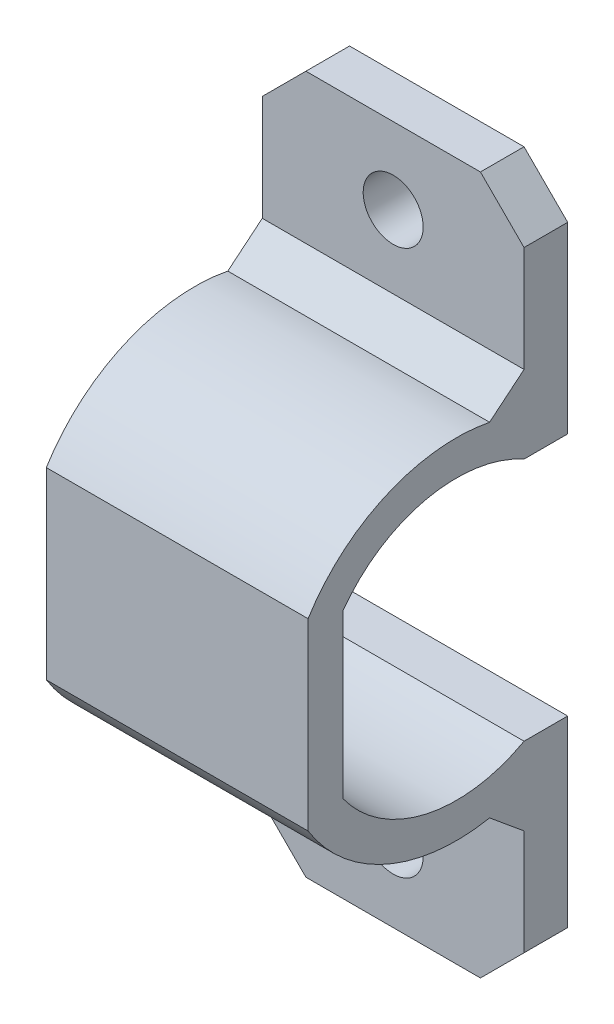
ISO-10303-21;
HEADER;
FILE_DESCRIPTION(('STEP AP214'),'2;1');
FILE_NAME('part.step','',(''),(''),'','','');
FILE_SCHEMA(('AUTOMOTIVE_DESIGN { 1 0 10303 214 1 1 1 1 }'));
ENDSEC;
DATA;
#1=APPLICATION_CONTEXT('core data for automotive mechanical design processes');
#2=APPLICATION_PROTOCOL_DEFINITION('international standard','automotive_design',2000,#1);
#3=PRODUCT_CONTEXT('',#1,'mechanical');
#4=PRODUCT('Part','Part','',(#3));
#5=PRODUCT_RELATED_PRODUCT_CATEGORY('part','',(#4));
#6=PRODUCT_DEFINITION_FORMATION('','',#4);
#7=PRODUCT_DEFINITION_CONTEXT('part definition',#1,'design');
#8=PRODUCT_DEFINITION('design','',#6,#7);
#9=PRODUCT_DEFINITION_SHAPE('','',#8);
#10=(LENGTH_UNIT() NAMED_UNIT(*) SI_UNIT(.MILLI.,.METRE.));
#11=(NAMED_UNIT(*) PLANE_ANGLE_UNIT() SI_UNIT($,.RADIAN.));
#12=(NAMED_UNIT(*) SI_UNIT($,.STERADIAN.) SOLID_ANGLE_UNIT());
#13=UNCERTAINTY_MEASURE_WITH_UNIT(LENGTH_MEASURE(1.E-05),#10,'distance_accuracy_value','');
#14=(GEOMETRIC_REPRESENTATION_CONTEXT(3) GLOBAL_UNCERTAINTY_ASSIGNED_CONTEXT((#13)) GLOBAL_UNIT_ASSIGNED_CONTEXT((#10,
#11,#12)) REPRESENTATION_CONTEXT('',''));
#15=CARTESIAN_POINT('',(0.,0.,0.));
#16=DIRECTION('',(0.,0.,1.));
#17=DIRECTION('',(1.,0.,0.));
#18=AXIS2_PLACEMENT_3D('',#15,#16,#17);
#19=CARTESIAN_POINT('',(6.,16.,-4.1));
#20=DIRECTION('',(0.,-1.,0.));
#21=DIRECTION('',(0.,0.,-1.));
#22=AXIS2_PLACEMENT_3D('',#19,#20,#21);
#23=PLANE('',#22);
#24=DIRECTION('',(-1.,0.,0.));
#25=VECTOR('',#24,1.);
#26=CARTESIAN_POINT('',(6.,16.,-5.1));
#27=LINE('',#26,#25);
#28=CARTESIAN_POINT('',(4.,16.,-5.1));
#29=VERTEX_POINT('',#28);
#30=CARTESIAN_POINT('',(-4.,16.,-5.1));
#31=VERTEX_POINT('',#30);
#32=EDGE_CURVE('E339',#29,#31,#27,.T.);
#33=ORIENTED_EDGE('',*,*,#32,.T.);
#34=DIRECTION('',(0.,0.,1.));
#35=VECTOR('',#34,1.);
#36=CARTESIAN_POINT('',(-4.,16.,-4.1));
#37=LINE('',#36,#35);
#38=CARTESIAN_POINT('',(-4.,16.,-3.1));
#39=VERTEX_POINT('',#38);
#40=EDGE_CURVE('E387',#31,#39,#37,.T.);
#41=ORIENTED_EDGE('',*,*,#40,.T.);
#42=DIRECTION('',(-1.,0.,0.));
#43=VECTOR('',#42,1.);
#44=CARTESIAN_POINT('',(6.,16.,-3.1));
#45=LINE('',#44,#43);
#46=CARTESIAN_POINT('',(4.,16.,-3.1));
#47=VERTEX_POINT('',#46);
#48=EDGE_CURVE('E377',#47,#39,#45,.T.);
#49=ORIENTED_EDGE('',*,*,#48,.F.);
#50=DIRECTION('',(0.,0.,-1.));
#51=VECTOR('',#50,1.);
#52=CARTESIAN_POINT('',(4.,16.,-5.1));
#53=LINE('',#52,#51);
#54=EDGE_CURVE('E381',#47,#29,#53,.T.);
#55=ORIENTED_EDGE('',*,*,#54,.T.);
#56=EDGE_LOOP('',(#33,#41,#49,#55));
#57=FACE_BOUND('',#56,.T.);
#58=ADVANCED_FACE('F15',(#57),#23,.F.);
#59=CARTESIAN_POINT('',(6.,11.6874788134985,-3.1));
#60=DIRECTION('',(0.,0.,-1.));
#61=DIRECTION('',(0.,1.,0.));
#62=AXIS2_PLACEMENT_3D('',#59,#60,#61);
#63=PLANE('',#62);
#64=CARTESIAN_POINT('',(0.,12.5,-3.1));
#65=DIRECTION('',(0.,0.,-1.));
#66=DIRECTION('',(0.,1.,0.));
#67=AXIS2_PLACEMENT_3D('',#64,#65,#66);
#68=CIRCLE('',#67,1.375);
#69=CARTESIAN_POINT('',(0.,13.875,-3.1));
#70=VERTEX_POINT('',#69);
#71=EDGE_CURVE('E316',#70,#70,#68,.T.);
#72=ORIENTED_EDGE('',*,*,#71,.T.);
#73=EDGE_LOOP('',(#72));
#74=FACE_BOUND('',#73,.T.);
#75=DIRECTION('',(0.,-1.,0.));
#76=VECTOR('',#75,1.);
#77=CARTESIAN_POINT('',(-6.,11.6874788134985,-3.1));
#78=LINE('',#77,#76);
#79=CARTESIAN_POINT('',(-6.,14.,-3.1));
#80=VERTEX_POINT('',#79);
#81=CARTESIAN_POINT('',(-6.,9.15913917942007,-3.1));
#82=VERTEX_POINT('',#81);
#83=EDGE_CURVE('E320',#80,#82,#78,.T.);
#84=ORIENTED_EDGE('',*,*,#83,.T.);
#85=DIRECTION('',(1.,0.,0.));
#86=VECTOR('',#85,1.);
#87=CARTESIAN_POINT('',(6.,9.15913917942007,-3.1));
#88=LINE('',#87,#86);
#89=CARTESIAN_POINT('',(6.,9.15913917942007,-3.1));
#90=VERTEX_POINT('',#89);
#91=EDGE_CURVE('E36',#82,#90,#88,.T.);
#92=ORIENTED_EDGE('',*,*,#91,.T.);
#93=DIRECTION('',(0.,-1.,0.));
#94=VECTOR('',#93,1.);
#95=CARTESIAN_POINT('',(6.,11.6874788134985,-3.1));
#96=LINE('',#95,#94);
#97=CARTESIAN_POINT('',(6.,14.,-3.1));
#98=VERTEX_POINT('',#97);
#99=EDGE_CURVE('E321',#98,#90,#96,.T.);
#100=ORIENTED_EDGE('',*,*,#99,.F.);
#101=DIRECTION('',(-0.707106781186548,0.707106781186548,0.));
#102=VECTOR('',#101,1.);
#103=CARTESIAN_POINT('',(6.,14.,-3.1));
#104=LINE('',#103,#102);
#105=EDGE_CURVE('E391',#98,#47,#104,.T.);
#106=ORIENTED_EDGE('',*,*,#105,.T.);
#107=ORIENTED_EDGE('',*,*,#48,.T.);
#108=DIRECTION('',(0.707106781186548,0.707106781186548,0.));
#109=VECTOR('',#108,1.);
#110=CARTESIAN_POINT('',(-4.,16.,-3.1));
#111=LINE('',#110,#109);
#112=EDGE_CURVE('E394',#39,#80,#111,.F.);
#113=ORIENTED_EDGE('',*,*,#112,.T.);
#114=EDGE_LOOP('',(#84,#92,#100,#106,#107,#113));
#115=FACE_BOUND('',#114,.T.);
#116=ADVANCED_FACE('F500',(#74,#115),#63,.F.);
#117=CARTESIAN_POINT('',(6.,0.,0.));
#118=DIRECTION('',(-1.,0.,0.));
#119=DIRECTION('',(0.,0.,1.));
#120=AXIS2_PLACEMENT_3D('',#117,#118,#119);
#121=CYLINDRICAL_SURFACE('',#120,8.);
#122=CARTESIAN_POINT('',(6.,0.,0.));
#123=DIRECTION('',(-1.,0.,0.));
#124=DIRECTION('',(0.,0.,-1.));
#125=AXIS2_PLACEMENT_3D('',#122,#123,#124);
#126=CIRCLE('',#125,8.);
#127=CARTESIAN_POINT('',(6.,4.2142615011411,6.8));
#128=VERTEX_POINT('',#127);
#129=CARTESIAN_POINT('',(6.,7.85448792630598,-1.51888755854856));
#130=VERTEX_POINT('',#129);
#131=EDGE_CURVE('E206',#128,#130,#126,.T.);
#132=ORIENTED_EDGE('',*,*,#131,.T.);
#133=DIRECTION('',(-1.,0.,0.));
#134=VECTOR('',#133,1.);
#135=CARTESIAN_POINT('',(6.,7.85448792630598,-1.51888755854856));
#136=LINE('',#135,#134);
#137=CARTESIAN_POINT('',(-6.,7.85448792630598,-1.51888755854856));
#138=VERTEX_POINT('',#137);
#139=EDGE_CURVE('E416',#130,#138,#136,.T.);
#140=ORIENTED_EDGE('',*,*,#139,.T.);
#141=CARTESIAN_POINT('',(-6.,0.,0.));
#142=DIRECTION('',(-1.,0.,0.));
#143=DIRECTION('',(0.,0.,-1.));
#144=AXIS2_PLACEMENT_3D('',#141,#142,#143);
#145=CIRCLE('',#144,8.);
#146=CARTESIAN_POINT('',(-6.,4.2142615011411,6.8));
#147=VERTEX_POINT('',#146);
#148=EDGE_CURVE('E342',#147,#138,#145,.T.);
#149=ORIENTED_EDGE('',*,*,#148,.F.);
#150=DIRECTION('',(-1.,0.,0.));
#151=VECTOR('',#150,1.);
#152=CARTESIAN_POINT('',(6.,4.2142615011411,6.8));
#153=LINE('',#152,#151);
#154=EDGE_CURVE('E374',#128,#147,#153,.T.);
#155=ORIENTED_EDGE('',*,*,#154,.F.);
#156=EDGE_LOOP('',(#132,#140,#149,#155));
#157=FACE_BOUND('',#156,.T.);
#158=ADVANCED_FACE('F527',(#157),#121,.T.);
#159=CARTESIAN_POINT('',(6.,2.10713075057055,6.8));
#160=DIRECTION('',(0.,0.,1.));
#161=DIRECTION('',(1.,0.,0.));
#162=AXIS2_PLACEMENT_3D('',#159,#160,#161);
#163=PLANE('',#162);
#164=DIRECTION('',(0.,1.,0.));
#165=VECTOR('',#164,1.);
#166=CARTESIAN_POINT('',(-6.,2.10713075057055,6.8));
#167=LINE('',#166,#165);
#168=CARTESIAN_POINT('',(-6.,-4.2142615011411,6.8));
#169=VERTEX_POINT('',#168);
#170=EDGE_CURVE('E215',#169,#147,#167,.T.);
#171=ORIENTED_EDGE('',*,*,#170,.F.);
#172=DIRECTION('',(-1.,0.,0.));
#173=VECTOR('',#172,1.);
#174=CARTESIAN_POINT('',(6.,-4.2142615011411,6.8));
#175=LINE('',#174,#173);
#176=CARTESIAN_POINT('',(6.,-4.2142615011411,6.8));
#177=VERTEX_POINT('',#176);
#178=EDGE_CURVE('E212',#177,#169,#175,.T.);
#179=ORIENTED_EDGE('',*,*,#178,.F.);
#180=DIRECTION('',(0.,1.,0.));
#181=VECTOR('',#180,1.);
#182=CARTESIAN_POINT('',(6.,2.10713075057055,6.8));
#183=LINE('',#182,#181);
#184=EDGE_CURVE('E198',#177,#128,#183,.T.);
#185=ORIENTED_EDGE('',*,*,#184,.T.);
#186=ORIENTED_EDGE('',*,*,#154,.T.);
#187=EDGE_LOOP('',(#171,#179,#185,#186));
#188=FACE_BOUND('',#187,.T.);
#189=ADVANCED_FACE('F213',(#188),#163,.T.);
#190=CARTESIAN_POINT('',(6.,1.86547581061776,5.2));
#191=DIRECTION('',(0.,0.,1.));
#192=DIRECTION('',(1.,0.,0.));
#193=AXIS2_PLACEMENT_3D('',#190,#191,#192);
#194=PLANE('',#193);
#195=DIRECTION('',(0.,1.,0.));
#196=VECTOR('',#195,1.);
#197=CARTESIAN_POINT('',(-6.,1.86547581061776,5.2));
#198=LINE('',#197,#196);
#199=CARTESIAN_POINT('',(-6.,-3.73095162123552,5.2));
#200=VERTEX_POINT('',#199);
#201=CARTESIAN_POINT('',(-6.,3.73095162123552,5.2));
#202=VERTEX_POINT('',#201);
#203=EDGE_CURVE('E347',#200,#202,#198,.T.);
#204=ORIENTED_EDGE('',*,*,#203,.T.);
#205=DIRECTION('',(-1.,0.,0.));
#206=VECTOR('',#205,1.);
#207=CARTESIAN_POINT('',(6.,3.73095162123552,5.2));
#208=LINE('',#207,#206);
#209=CARTESIAN_POINT('',(6.,3.73095162123552,5.2));
#210=VERTEX_POINT('',#209);
#211=EDGE_CURVE('E370',#210,#202,#208,.T.);
#212=ORIENTED_EDGE('',*,*,#211,.F.);
#213=DIRECTION('',(0.,1.,0.));
#214=VECTOR('',#213,1.);
#215=CARTESIAN_POINT('',(6.,1.86547581061776,5.2));
#216=LINE('',#215,#214);
#217=CARTESIAN_POINT('',(6.,-3.73095162123552,5.2));
#218=VERTEX_POINT('',#217);
#219=EDGE_CURVE('E209',#218,#210,#216,.T.);
#220=ORIENTED_EDGE('',*,*,#219,.F.);
#221=DIRECTION('',(-1.,0.,0.));
#222=VECTOR('',#221,1.);
#223=CARTESIAN_POINT('',(6.,-3.73095162123552,5.2));
#224=LINE('',#223,#222);
#225=EDGE_CURVE('E221',#218,#200,#224,.T.);
#226=ORIENTED_EDGE('',*,*,#225,.T.);
#227=EDGE_LOOP('',(#204,#212,#220,#226));
#228=FACE_BOUND('',#227,.T.);
#229=ADVANCED_FACE('F484',(#228),#194,.F.);
#230=CARTESIAN_POINT('',(6.,0.,0.));
#231=DIRECTION('',(-1.,0.,0.));
#232=DIRECTION('',(0.,0.,1.));
#233=AXIS2_PLACEMENT_3D('',#230,#231,#232);
#234=CYLINDRICAL_SURFACE('',#233,6.4);
#235=CARTESIAN_POINT('',(-6.,0.,0.));
#236=DIRECTION('',(-1.,0.,0.));
#237=DIRECTION('',(0.,0.,-1.));
#238=AXIS2_PLACEMENT_3D('',#235,#236,#237);
#239=CIRCLE('',#238,6.4);
#240=CARTESIAN_POINT('',(-6.,5.59910707166777,-3.1));
#241=VERTEX_POINT('',#240);
#242=EDGE_CURVE('E350',#202,#241,#239,.T.);
#243=ORIENTED_EDGE('',*,*,#242,.T.);
#244=DIRECTION('',(-1.,0.,0.));
#245=VECTOR('',#244,1.);
#246=CARTESIAN_POINT('',(6.,5.59910707166777,-3.1));
#247=LINE('',#246,#245);
#248=CARTESIAN_POINT('',(6.,5.59910707166777,-3.1));
#249=VERTEX_POINT('',#248);
#250=EDGE_CURVE('E366',#249,#241,#247,.T.);
#251=ORIENTED_EDGE('',*,*,#250,.F.);
#252=CARTESIAN_POINT('',(6.,0.,0.));
#253=DIRECTION('',(-1.,0.,0.));
#254=DIRECTION('',(0.,0.,-1.));
#255=AXIS2_PLACEMENT_3D('',#252,#253,#254);
#256=CIRCLE('',#255,6.4);
#257=EDGE_CURVE('E329',#210,#249,#256,.T.);
#258=ORIENTED_EDGE('',*,*,#257,.F.);
#259=ORIENTED_EDGE('',*,*,#211,.T.);
#260=EDGE_LOOP('',(#243,#251,#258,#259));
#261=FACE_BOUND('',#260,.T.);
#262=ADVANCED_FACE('F487',(#261),#234,.F.);
#263=CARTESIAN_POINT('',(6.,5.59910707166777,-4.1));
#264=DIRECTION('',(0.,1.,0.));
#265=DIRECTION('',(0.,0.,1.));
#266=AXIS2_PLACEMENT_3D('',#263,#264,#265);
#267=PLANE('',#266);
#268=DIRECTION('',(0.,0.,-1.));
#269=VECTOR('',#268,1.);
#270=CARTESIAN_POINT('',(-6.,5.59910707166777,-4.1));
#271=LINE('',#270,#269);
#272=CARTESIAN_POINT('',(-6.,5.59910707166777,-5.1));
#273=VERTEX_POINT('',#272);
#274=EDGE_CURVE('E353',#241,#273,#271,.T.);
#275=ORIENTED_EDGE('',*,*,#274,.T.);
#276=DIRECTION('',(-1.,0.,0.));
#277=VECTOR('',#276,1.);
#278=CARTESIAN_POINT('',(6.,5.59910707166777,-5.1));
#279=LINE('',#278,#277);
#280=CARTESIAN_POINT('',(6.,5.59910707166777,-5.1));
#281=VERTEX_POINT('',#280);
#282=EDGE_CURVE('E362',#281,#273,#279,.T.);
#283=ORIENTED_EDGE('',*,*,#282,.F.);
#284=DIRECTION('',(0.,0.,-1.));
#285=VECTOR('',#284,1.);
#286=CARTESIAN_POINT('',(6.,5.59910707166777,-4.1));
#287=LINE('',#286,#285);
#288=EDGE_CURVE('E332',#249,#281,#287,.T.);
#289=ORIENTED_EDGE('',*,*,#288,.F.);
#290=ORIENTED_EDGE('',*,*,#250,.T.);
#291=EDGE_LOOP('',(#275,#283,#289,#290));
#292=FACE_BOUND('',#291,.T.);
#293=ADVANCED_FACE('F492',(#292),#267,.F.);
#294=CARTESIAN_POINT('',(6.,10.7995535358339,-5.1));
#295=DIRECTION('',(0.,0.,-1.));
#296=DIRECTION('',(0.,1.,0.));
#297=AXIS2_PLACEMENT_3D('',#294,#295,#296);
#298=PLANE('',#297);
#299=CARTESIAN_POINT('',(0.,12.5,-5.1));
#300=DIRECTION('',(0.,0.,-1.));
#301=DIRECTION('',(0.,1.,0.));
#302=AXIS2_PLACEMENT_3D('',#299,#300,#301);
#303=CIRCLE('',#302,1.375);
#304=CARTESIAN_POINT('',(0.,13.875,-5.1));
#305=VERTEX_POINT('',#304);
#306=EDGE_CURVE('E315',#305,#305,#303,.T.);
#307=ORIENTED_EDGE('',*,*,#306,.F.);
#308=EDGE_LOOP('',(#307));
#309=FACE_BOUND('',#308,.T.);
#310=DIRECTION('',(0.,-1.,0.));
#311=VECTOR('',#310,1.);
#312=CARTESIAN_POINT('',(-6.,10.7995535358339,-5.1));
#313=LINE('',#312,#311);
#314=CARTESIAN_POINT('',(-6.,14.,-5.1));
#315=VERTEX_POINT('',#314);
#316=EDGE_CURVE('E324',#315,#273,#313,.T.);
#317=ORIENTED_EDGE('',*,*,#316,.F.);
#318=DIRECTION('',(-0.707106781186548,-0.707106781186548,0.));
#319=VECTOR('',#318,1.);
#320=CARTESIAN_POINT('',(-1.60022323208306,18.3997767679169,-5.1));
#321=LINE('',#320,#319);
#322=EDGE_CURVE('E403',#315,#31,#321,.F.);
#323=ORIENTED_EDGE('',*,*,#322,.T.);
#324=ORIENTED_EDGE('',*,*,#32,.F.);
#325=DIRECTION('',(0.707106781186548,-0.707106781186548,0.));
#326=VECTOR('',#325,1.);
#327=CARTESIAN_POINT('',(7.60022323208306,12.3997767679169,-5.1));
#328=LINE('',#327,#326);
#329=CARTESIAN_POINT('',(6.,14.,-5.1));
#330=VERTEX_POINT('',#329);
#331=EDGE_CURVE('E400',#29,#330,#328,.T.);
#332=ORIENTED_EDGE('',*,*,#331,.T.);
#333=DIRECTION('',(0.,-1.,0.));
#334=VECTOR('',#333,1.);
#335=CARTESIAN_POINT('',(6.,10.7995535358339,-5.1));
#336=LINE('',#335,#334);
#337=EDGE_CURVE('E336',#330,#281,#336,.T.);
#338=ORIENTED_EDGE('',*,*,#337,.T.);
#339=ORIENTED_EDGE('',*,*,#282,.T.);
#340=EDGE_LOOP('',(#317,#323,#324,#332,#338,#339));
#341=FACE_BOUND('',#340,.T.);
#342=ADVANCED_FACE('F509',(#309,#341),#298,.T.);
#343=CARTESIAN_POINT('',(6.,1.7821812927723,0.4));
#344=DIRECTION('',(1.,0.,0.));
#345=DIRECTION('',(0.,1.,0.));
#346=AXIS2_PLACEMENT_3D('',#343,#344,#345);
#347=PLANE('',#346);
#348=ORIENTED_EDGE('',*,*,#337,.F.);
#349=DIRECTION('',(0.,0.,1.));
#350=VECTOR('',#349,1.);
#351=CARTESIAN_POINT('',(6.,14.,-3.1));
#352=LINE('',#351,#350);
#353=EDGE_CURVE('E406',#330,#98,#352,.T.);
#354=ORIENTED_EDGE('',*,*,#353,.T.);
#355=ORIENTED_EDGE('',*,*,#99,.T.);
#356=DIRECTION('',(0.,-0.636450726757944,0.771317361667222));
#357=VECTOR('',#356,1.);
#358=CARTESIAN_POINT('',(6.,7.85448792630598,-1.51888755854856));
#359=LINE('',#358,#357);
#360=EDGE_CURVE('E9',#90,#130,#359,.T.);
#361=ORIENTED_EDGE('',*,*,#360,.T.);
#362=ORIENTED_EDGE('',*,*,#131,.F.);
#363=ORIENTED_EDGE('',*,*,#184,.F.);
#364=CARTESIAN_POINT('',(6.,0.,0.));
#365=DIRECTION('',(1.,0.,0.));
#366=DIRECTION('',(0.,0.,-1.));
#367=AXIS2_PLACEMENT_3D('',#364,#365,#366);
#368=CIRCLE('',#367,8.);
#369=CARTESIAN_POINT('',(6.,-7.85448792630598,-1.51888755854856));
#370=VERTEX_POINT('',#369);
#371=EDGE_CURVE('E203',#177,#370,#368,.T.);
#372=ORIENTED_EDGE('',*,*,#371,.T.);
#373=DIRECTION('',(0.,-0.636450726757944,-0.771317361667222));
#374=VECTOR('',#373,1.);
#375=CARTESIAN_POINT('',(6.,-9.15913917942007,-3.1));
#376=LINE('',#375,#374);
#377=CARTESIAN_POINT('',(6.,-9.15913917942007,-3.1));
#378=VERTEX_POINT('',#377);
#379=EDGE_CURVE('E425',#370,#378,#376,.T.);
#380=ORIENTED_EDGE('',*,*,#379,.T.);
#381=DIRECTION('',(0.,1.,0.));
#382=VECTOR('',#381,1.);
#383=CARTESIAN_POINT('',(6.,-11.6874788134985,-3.1));
#384=LINE('',#383,#382);
#385=CARTESIAN_POINT('',(6.,-14.,-3.1));
#386=VERTEX_POINT('',#385);
#387=EDGE_CURVE('E228',#386,#378,#384,.T.);
#388=ORIENTED_EDGE('',*,*,#387,.F.);
#389=DIRECTION('',(0.,0.,1.));
#390=VECTOR('',#389,1.);
#391=CARTESIAN_POINT('',(6.,-14.,-3.1));
#392=LINE('',#391,#390);
#393=CARTESIAN_POINT('',(6.,-14.,-5.1));
#394=VERTEX_POINT('',#393);
#395=EDGE_CURVE('E312',#394,#386,#392,.T.);
#396=ORIENTED_EDGE('',*,*,#395,.F.);
#397=DIRECTION('',(0.,1.,0.));
#398=VECTOR('',#397,1.);
#399=CARTESIAN_POINT('',(6.,-10.7995535358339,-5.1));
#400=LINE('',#399,#398);
#401=CARTESIAN_POINT('',(6.,-5.59910707166777,-5.1));
#402=VERTEX_POINT('',#401);
#403=EDGE_CURVE('E246',#394,#402,#400,.T.);
#404=ORIENTED_EDGE('',*,*,#403,.T.);
#405=DIRECTION('',(0.,0.,-1.));
#406=VECTOR('',#405,1.);
#407=CARTESIAN_POINT('',(6.,-5.59910707166777,-4.1));
#408=LINE('',#407,#406);
#409=CARTESIAN_POINT('',(6.,-5.59910707166777,-3.1));
#410=VERTEX_POINT('',#409);
#411=EDGE_CURVE('E235',#410,#402,#408,.T.);
#412=ORIENTED_EDGE('',*,*,#411,.F.);
#413=CARTESIAN_POINT('',(6.,0.,0.));
#414=DIRECTION('',(1.,0.,0.));
#415=DIRECTION('',(0.,0.,-1.));
#416=AXIS2_PLACEMENT_3D('',#413,#414,#415);
#417=CIRCLE('',#416,6.4);
#418=EDGE_CURVE('E227',#218,#410,#417,.T.);
#419=ORIENTED_EDGE('',*,*,#418,.F.);
#420=ORIENTED_EDGE('',*,*,#219,.T.);
#421=ORIENTED_EDGE('',*,*,#257,.T.);
#422=ORIENTED_EDGE('',*,*,#288,.T.);
#423=EDGE_LOOP('',(#348,#354,#355,#361,#362,#363,#372,#380,#388,#396,#404,#412,#419,#420,#421,#422));
#424=FACE_BOUND('',#423,.T.);
#425=ADVANCED_FACE('F201',(#424),#347,.T.);
#426=CARTESIAN_POINT('',(-6.,1.7821812927723,0.4));
#427=DIRECTION('',(1.,0.,0.));
#428=DIRECTION('',(0.,1.,0.));
#429=AXIS2_PLACEMENT_3D('',#426,#427,#428);
#430=PLANE('',#429);
#431=ORIENTED_EDGE('',*,*,#83,.F.);
#432=DIRECTION('',(0.,0.,-1.));
#433=VECTOR('',#432,1.);
#434=CARTESIAN_POINT('',(-6.,14.,0.4));
#435=LINE('',#434,#433);
#436=EDGE_CURVE('E397',#80,#315,#435,.T.);
#437=ORIENTED_EDGE('',*,*,#436,.T.);
#438=ORIENTED_EDGE('',*,*,#316,.T.);
#439=ORIENTED_EDGE('',*,*,#274,.F.);
#440=ORIENTED_EDGE('',*,*,#242,.F.);
#441=ORIENTED_EDGE('',*,*,#203,.F.);
#442=CARTESIAN_POINT('',(-6.,0.,0.));
#443=DIRECTION('',(1.,0.,0.));
#444=DIRECTION('',(0.,0.,-1.));
#445=AXIS2_PLACEMENT_3D('',#442,#443,#444);
#446=CIRCLE('',#445,6.4);
#447=CARTESIAN_POINT('',(-6.,-5.59910707166777,-3.1));
#448=VERTEX_POINT('',#447);
#449=EDGE_CURVE('E256',#200,#448,#446,.T.);
#450=ORIENTED_EDGE('',*,*,#449,.T.);
#451=DIRECTION('',(0.,0.,-1.));
#452=VECTOR('',#451,1.);
#453=CARTESIAN_POINT('',(-6.,-5.59910707166777,-4.1));
#454=LINE('',#453,#452);
#455=CARTESIAN_POINT('',(-6.,-5.59910707166777,-5.1));
#456=VERTEX_POINT('',#455);
#457=EDGE_CURVE('E260',#448,#456,#454,.T.);
#458=ORIENTED_EDGE('',*,*,#457,.T.);
#459=DIRECTION('',(0.,1.,0.));
#460=VECTOR('',#459,1.);
#461=CARTESIAN_POINT('',(-6.,-10.7995535358339,-5.1));
#462=LINE('',#461,#460);
#463=CARTESIAN_POINT('',(-6.,-14.,-5.1));
#464=VERTEX_POINT('',#463);
#465=EDGE_CURVE('E239',#464,#456,#462,.T.);
#466=ORIENTED_EDGE('',*,*,#465,.F.);
#467=DIRECTION('',(0.,0.,-1.));
#468=VECTOR('',#467,1.);
#469=CARTESIAN_POINT('',(-6.,-14.,0.4));
#470=LINE('',#469,#468);
#471=CARTESIAN_POINT('',(-6.,-14.,-3.1));
#472=VERTEX_POINT('',#471);
#473=EDGE_CURVE('E302',#472,#464,#470,.T.);
#474=ORIENTED_EDGE('',*,*,#473,.F.);
#475=DIRECTION('',(0.,1.,0.));
#476=VECTOR('',#475,1.);
#477=CARTESIAN_POINT('',(-6.,-11.6874788134985,-3.1));
#478=LINE('',#477,#476);
#479=CARTESIAN_POINT('',(-6.,-9.15913917942007,-3.1));
#480=VERTEX_POINT('',#479);
#481=EDGE_CURVE('E250',#472,#480,#478,.T.);
#482=ORIENTED_EDGE('',*,*,#481,.T.);
#483=DIRECTION('',(0.,0.636450726757944,0.771317361667222));
#484=VECTOR('',#483,1.);
#485=CARTESIAN_POINT('',(-6.,-3.00897443065105,4.35341100009995));
#486=LINE('',#485,#484);
#487=CARTESIAN_POINT('',(-6.,-7.85448792630598,-1.51888755854856));
#488=VERTEX_POINT('',#487);
#489=EDGE_CURVE('E422',#480,#488,#486,.T.);
#490=ORIENTED_EDGE('',*,*,#489,.T.);
#491=CARTESIAN_POINT('',(-6.,0.,0.));
#492=DIRECTION('',(1.,0.,0.));
#493=DIRECTION('',(0.,0.,-1.));
#494=AXIS2_PLACEMENT_3D('',#491,#492,#493);
#495=CIRCLE('',#494,8.);
#496=EDGE_CURVE('E253',#169,#488,#495,.T.);
#497=ORIENTED_EDGE('',*,*,#496,.F.);
#498=ORIENTED_EDGE('',*,*,#170,.T.);
#499=ORIENTED_EDGE('',*,*,#148,.T.);
#500=DIRECTION('',(0.,0.636450726757944,-0.771317361667222));
#501=VECTOR('',#500,1.);
#502=CARTESIAN_POINT('',(-6.,4.45278909933962,2.60364581927891));
#503=LINE('',#502,#501);
#504=EDGE_CURVE('E24',#138,#82,#503,.T.);
#505=ORIENTED_EDGE('',*,*,#504,.T.);
#506=EDGE_LOOP('',(#431,#437,#438,#439,#440,#441,#450,#458,#466,#474,#482,#490,#497,#498,#499,#505));
#507=FACE_BOUND('',#506,.T.);
#508=ADVANCED_FACE('F456',(#507),#430,.F.);
#509=CARTESIAN_POINT('',(0.,12.5,-23.2825159791545));
#510=DIRECTION('',(0.,0.,1.));
#511=DIRECTION('',(1.,0.,0.));
#512=AXIS2_PLACEMENT_3D('',#509,#510,#511);
#513=CYLINDRICAL_SURFACE('',#512,1.375);
#514=ORIENTED_EDGE('',*,*,#306,.T.);
#515=EDGE_LOOP('',(#514));
#516=FACE_BOUND('',#515,.T.);
#517=ORIENTED_EDGE('',*,*,#71,.F.);
#518=EDGE_LOOP('',(#517));
#519=FACE_BOUND('',#518,.T.);
#520=ADVANCED_FACE('F534',(#516,#519),#513,.F.);
#521=CARTESIAN_POINT('',(-4.,16.,-4.1));
#522=DIRECTION('',(0.707106781186548,-0.707106781186548,0.));
#523=DIRECTION('',(0.,0.,1.));
#524=AXIS2_PLACEMENT_3D('',#521,#522,#523);
#525=PLANE('',#524);
#526=ORIENTED_EDGE('',*,*,#322,.F.);
#527=ORIENTED_EDGE('',*,*,#436,.F.);
#528=ORIENTED_EDGE('',*,*,#112,.F.);
#529=ORIENTED_EDGE('',*,*,#40,.F.);
#530=EDGE_LOOP('',(#526,#527,#528,#529));
#531=FACE_BOUND('',#530,.T.);
#532=ADVANCED_FACE('F506',(#531),#525,.F.);
#533=CARTESIAN_POINT('',(6.,14.,0.4));
#534=DIRECTION('',(0.707106781186548,0.707106781186548,0.));
#535=DIRECTION('',(0.,0.,-1.));
#536=AXIS2_PLACEMENT_3D('',#533,#534,#535);
#537=PLANE('',#536);
#538=ORIENTED_EDGE('',*,*,#331,.F.);
#539=ORIENTED_EDGE('',*,*,#54,.F.);
#540=ORIENTED_EDGE('',*,*,#105,.F.);
#541=ORIENTED_EDGE('',*,*,#353,.F.);
#542=EDGE_LOOP('',(#538,#539,#540,#541));
#543=FACE_BOUND('',#542,.T.);
#544=ADVANCED_FACE('F497',(#543),#537,.T.);
#545=CARTESIAN_POINT('',(6.,-16.,-4.1));
#546=DIRECTION('',(0.,1.,0.));
#547=DIRECTION('',(0.,0.,-1.));
#548=AXIS2_PLACEMENT_3D('',#545,#546,#547);
#549=PLANE('',#548);
#550=DIRECTION('',(-1.,0.,0.));
#551=VECTOR('',#550,1.);
#552=CARTESIAN_POINT('',(6.,-16.,-5.1));
#553=LINE('',#552,#551);
#554=CARTESIAN_POINT('',(4.,-16.,-5.1));
#555=VERTEX_POINT('',#554);
#556=CARTESIAN_POINT('',(-4.,-16.,-5.1));
#557=VERTEX_POINT('',#556);
#558=EDGE_CURVE('E249',#555,#557,#553,.T.);
#559=ORIENTED_EDGE('',*,*,#558,.F.);
#560=DIRECTION('',(0.,0.,-1.));
#561=VECTOR('',#560,1.);
#562=CARTESIAN_POINT('',(4.,-16.,-5.1));
#563=LINE('',#562,#561);
#564=CARTESIAN_POINT('',(4.,-16.,-3.1));
#565=VERTEX_POINT('',#564);
#566=EDGE_CURVE('E283',#565,#555,#563,.T.);
#567=ORIENTED_EDGE('',*,*,#566,.F.);
#568=DIRECTION('',(-1.,0.,0.));
#569=VECTOR('',#568,1.);
#570=CARTESIAN_POINT('',(6.,-16.,-3.1));
#571=LINE('',#570,#569);
#572=CARTESIAN_POINT('',(-4.,-16.,-3.1));
#573=VERTEX_POINT('',#572);
#574=EDGE_CURVE('E220',#565,#573,#571,.T.);
#575=ORIENTED_EDGE('',*,*,#574,.T.);
#576=DIRECTION('',(0.,0.,1.));
#577=VECTOR('',#576,1.);
#578=CARTESIAN_POINT('',(-4.,-16.,-4.1));
#579=LINE('',#578,#577);
#580=EDGE_CURVE('E291',#557,#573,#579,.T.);
#581=ORIENTED_EDGE('',*,*,#580,.F.);
#582=EDGE_LOOP('',(#559,#567,#575,#581));
#583=FACE_BOUND('',#582,.T.);
#584=ADVANCED_FACE('F465',(#583),#549,.F.);
#585=CARTESIAN_POINT('',(6.,-11.6874788134985,-3.1));
#586=DIRECTION('',(0.,0.,-1.));
#587=DIRECTION('',(0.,-1.,0.));
#588=AXIS2_PLACEMENT_3D('',#585,#586,#587);
#589=PLANE('',#588);
#590=CARTESIAN_POINT('',(0.,-12.5,-3.1));
#591=DIRECTION('',(0.,0.,1.));
#592=DIRECTION('',(0.,-1.,0.));
#593=AXIS2_PLACEMENT_3D('',#590,#591,#592);
#594=CIRCLE('',#593,1.375);
#595=CARTESIAN_POINT('',(0.,-13.875,-3.1));
#596=VERTEX_POINT('',#595);
#597=EDGE_CURVE('E254',#596,#596,#594,.T.);
#598=ORIENTED_EDGE('',*,*,#597,.F.);
#599=EDGE_LOOP('',(#598));
#600=FACE_BOUND('',#599,.T.);
#601=ORIENTED_EDGE('',*,*,#387,.T.);
#602=DIRECTION('',(-1.,0.,0.));
#603=VECTOR('',#602,1.);
#604=CARTESIAN_POINT('',(6.,-9.15913917942007,-3.1));
#605=LINE('',#604,#603);
#606=EDGE_CURVE('E410',#378,#480,#605,.T.);
#607=ORIENTED_EDGE('',*,*,#606,.T.);
#608=ORIENTED_EDGE('',*,*,#481,.F.);
#609=DIRECTION('',(0.707106781186548,-0.707106781186548,0.));
#610=VECTOR('',#609,1.);
#611=CARTESIAN_POINT('',(-4.,-16.,-3.1));
#612=LINE('',#611,#610);
#613=EDGE_CURVE('E298',#573,#472,#612,.F.);
#614=ORIENTED_EDGE('',*,*,#613,.F.);
#615=ORIENTED_EDGE('',*,*,#574,.F.);
#616=DIRECTION('',(-0.707106781186548,-0.707106781186548,0.));
#617=VECTOR('',#616,1.);
#618=CARTESIAN_POINT('',(6.,-14.,-3.1));
#619=LINE('',#618,#617);
#620=EDGE_CURVE('E295',#386,#565,#619,.T.);
#621=ORIENTED_EDGE('',*,*,#620,.F.);
#622=EDGE_LOOP('',(#601,#607,#608,#614,#615,#621));
#623=FACE_BOUND('',#622,.T.);
#624=ADVANCED_FACE('F452',(#600,#623),#589,.F.);
#625=CARTESIAN_POINT('',(6.,0.,0.));
#626=DIRECTION('',(-1.,0.,0.));
#627=DIRECTION('',(0.,0.,1.));
#628=AXIS2_PLACEMENT_3D('',#625,#626,#627);
#629=CYLINDRICAL_SURFACE('',#628,8.);
#630=ORIENTED_EDGE('',*,*,#496,.T.);
#631=DIRECTION('',(-1.,0.,0.));
#632=VECTOR('',#631,1.);
#633=CARTESIAN_POINT('',(6.,-7.85448792630598,-1.51888755854856));
#634=LINE('',#633,#632);
#635=EDGE_CURVE('E225',#488,#370,#634,.F.);
#636=ORIENTED_EDGE('',*,*,#635,.T.);
#637=ORIENTED_EDGE('',*,*,#371,.F.);
#638=ORIENTED_EDGE('',*,*,#178,.T.);
#639=EDGE_LOOP('',(#630,#636,#637,#638));
#640=FACE_BOUND('',#639,.T.);
#641=ADVANCED_FACE('F223',(#640),#629,.T.);
#642=CARTESIAN_POINT('',(6.,0.,0.));
#643=DIRECTION('',(-1.,0.,0.));
#644=DIRECTION('',(0.,0.,1.));
#645=AXIS2_PLACEMENT_3D('',#642,#643,#644);
#646=CYLINDRICAL_SURFACE('',#645,6.4);
#647=ORIENTED_EDGE('',*,*,#449,.F.);
#648=ORIENTED_EDGE('',*,*,#225,.F.);
#649=ORIENTED_EDGE('',*,*,#418,.T.);
#650=DIRECTION('',(-1.,0.,0.));
#651=VECTOR('',#650,1.);
#652=CARTESIAN_POINT('',(6.,-5.59910707166777,-3.1));
#653=LINE('',#652,#651);
#654=EDGE_CURVE('E273',#410,#448,#653,.T.);
#655=ORIENTED_EDGE('',*,*,#654,.T.);
#656=EDGE_LOOP('',(#647,#648,#649,#655));
#657=FACE_BOUND('',#656,.T.);
#658=ADVANCED_FACE('F479',(#657),#646,.F.);
#659=CARTESIAN_POINT('',(6.,-5.59910707166777,-4.1));
#660=DIRECTION('',(0.,-1.,0.));
#661=DIRECTION('',(0.,0.,1.));
#662=AXIS2_PLACEMENT_3D('',#659,#660,#661);
#663=PLANE('',#662);
#664=ORIENTED_EDGE('',*,*,#457,.F.);
#665=ORIENTED_EDGE('',*,*,#654,.F.);
#666=ORIENTED_EDGE('',*,*,#411,.T.);
#667=DIRECTION('',(-1.,0.,0.));
#668=VECTOR('',#667,1.);
#669=CARTESIAN_POINT('',(6.,-5.59910707166777,-5.1));
#670=LINE('',#669,#668);
#671=EDGE_CURVE('E269',#402,#456,#670,.T.);
#672=ORIENTED_EDGE('',*,*,#671,.T.);
#673=EDGE_LOOP('',(#664,#665,#666,#672));
#674=FACE_BOUND('',#673,.T.);
#675=ADVANCED_FACE('F475',(#674),#663,.F.);
#676=CARTESIAN_POINT('',(6.,-10.7995535358339,-5.1));
#677=DIRECTION('',(0.,0.,-1.));
#678=DIRECTION('',(0.,-1.,0.));
#679=AXIS2_PLACEMENT_3D('',#676,#677,#678);
#680=PLANE('',#679);
#681=CARTESIAN_POINT('',(0.,-12.5,-5.1));
#682=DIRECTION('',(0.,0.,1.));
#683=DIRECTION('',(0.,-1.,0.));
#684=AXIS2_PLACEMENT_3D('',#681,#682,#683);
#685=CIRCLE('',#684,1.375);
#686=CARTESIAN_POINT('',(0.,-13.875,-5.1));
#687=VERTEX_POINT('',#686);
#688=EDGE_CURVE('E284',#687,#687,#685,.T.);
#689=ORIENTED_EDGE('',*,*,#688,.T.);
#690=EDGE_LOOP('',(#689));
#691=FACE_BOUND('',#690,.T.);
#692=ORIENTED_EDGE('',*,*,#465,.T.);
#693=ORIENTED_EDGE('',*,*,#671,.F.);
#694=ORIENTED_EDGE('',*,*,#403,.F.);
#695=DIRECTION('',(0.707106781186548,0.707106781186548,0.));
#696=VECTOR('',#695,1.);
#697=CARTESIAN_POINT('',(7.60022323208306,-12.3997767679169,-5.1));
#698=LINE('',#697,#696);
#699=EDGE_CURVE('E305',#555,#394,#698,.T.);
#700=ORIENTED_EDGE('',*,*,#699,.F.);
#701=ORIENTED_EDGE('',*,*,#558,.T.);
#702=DIRECTION('',(-0.707106781186548,0.707106781186548,0.));
#703=VECTOR('',#702,1.);
#704=CARTESIAN_POINT('',(-1.60022323208306,-18.3997767679169,-5.1));
#705=LINE('',#704,#703);
#706=EDGE_CURVE('E309',#464,#557,#705,.F.);
#707=ORIENTED_EDGE('',*,*,#706,.F.);
#708=EDGE_LOOP('',(#692,#693,#694,#700,#701,#707));
#709=FACE_BOUND('',#708,.T.);
#710=ADVANCED_FACE('F473',(#691,#709),#680,.T.);
#711=CARTESIAN_POINT('',(0.,-12.5,-23.2825159791545));
#712=DIRECTION('',(0.,0.,1.));
#713=DIRECTION('',(1.,0.,0.));
#714=AXIS2_PLACEMENT_3D('',#711,#712,#713);
#715=CYLINDRICAL_SURFACE('',#714,1.375);
#716=ORIENTED_EDGE('',*,*,#688,.F.);
#717=EDGE_LOOP('',(#716));
#718=FACE_BOUND('',#717,.T.);
#719=ORIENTED_EDGE('',*,*,#597,.T.);
#720=EDGE_LOOP('',(#719));
#721=FACE_BOUND('',#720,.T.);
#722=ADVANCED_FACE('F546',(#718,#721),#715,.F.);
#723=CARTESIAN_POINT('',(-4.,-16.,-4.1));
#724=DIRECTION('',(0.707106781186548,0.707106781186548,0.));
#725=DIRECTION('',(0.,0.,1.));
#726=AXIS2_PLACEMENT_3D('',#723,#724,#725);
#727=PLANE('',#726);
#728=ORIENTED_EDGE('',*,*,#706,.T.);
#729=ORIENTED_EDGE('',*,*,#580,.T.);
#730=ORIENTED_EDGE('',*,*,#613,.T.);
#731=ORIENTED_EDGE('',*,*,#473,.T.);
#732=EDGE_LOOP('',(#728,#729,#730,#731));
#733=FACE_BOUND('',#732,.T.);
#734=ADVANCED_FACE('F461',(#733),#727,.F.);
#735=CARTESIAN_POINT('',(6.,-14.,0.4));
#736=DIRECTION('',(0.707106781186548,-0.707106781186548,0.));
#737=DIRECTION('',(0.,0.,-1.));
#738=AXIS2_PLACEMENT_3D('',#735,#736,#737);
#739=PLANE('',#738);
#740=ORIENTED_EDGE('',*,*,#699,.T.);
#741=ORIENTED_EDGE('',*,*,#395,.T.);
#742=ORIENTED_EDGE('',*,*,#620,.T.);
#743=ORIENTED_EDGE('',*,*,#566,.T.);
#744=EDGE_LOOP('',(#740,#741,#742,#743));
#745=FACE_BOUND('',#744,.T.);
#746=ADVANCED_FACE('F467',(#745),#739,.T.);
#747=CARTESIAN_POINT('',(6.,-9.15913917942007,-3.1));
#748=DIRECTION('',(0.,0.771317361667222,-0.636450726757944));
#749=DIRECTION('',(-1.,0.,0.));
#750=AXIS2_PLACEMENT_3D('',#747,#748,#749);
#751=PLANE('',#750);
#752=ORIENTED_EDGE('',*,*,#379,.F.);
#753=ORIENTED_EDGE('',*,*,#635,.F.);
#754=ORIENTED_EDGE('',*,*,#489,.F.);
#755=ORIENTED_EDGE('',*,*,#606,.F.);
#756=EDGE_LOOP('',(#752,#753,#754,#755));
#757=FACE_BOUND('',#756,.T.);
#758=ADVANCED_FACE('F455',(#757),#751,.F.);
#759=CARTESIAN_POINT('',(6.,7.85448792630598,-1.51888755854856));
#760=DIRECTION('',(0.,-0.771317361667222,-0.636450726757944));
#761=DIRECTION('',(-1.,0.,0.));
#762=AXIS2_PLACEMENT_3D('',#759,#760,#761);
#763=PLANE('',#762);
#764=ORIENTED_EDGE('',*,*,#360,.F.);
#765=ORIENTED_EDGE('',*,*,#91,.F.);
#766=ORIENTED_EDGE('',*,*,#504,.F.);
#767=ORIENTED_EDGE('',*,*,#139,.F.);
#768=EDGE_LOOP('',(#764,#765,#766,#767));
#769=FACE_BOUND('',#768,.T.);
#770=ADVANCED_FACE('F17',(#769),#763,.F.);
#771=CLOSED_SHELL('',(#58,#116,#158,#189,#229,#262,#293,#342,#425,#508,#520,#532,#544,#584,#624,
#641,#658,#675,#710,#722,#734,#746,#758,#770));
#772=MANIFOLD_SOLID_BREP('B1',#771);
#773=ADVANCED_BREP_SHAPE_REPRESENTATION('',(#18,#772),#14);
#774=SHAPE_DEFINITION_REPRESENTATION(#9,#773);
ENDSEC;
END-ISO-10303-21;
